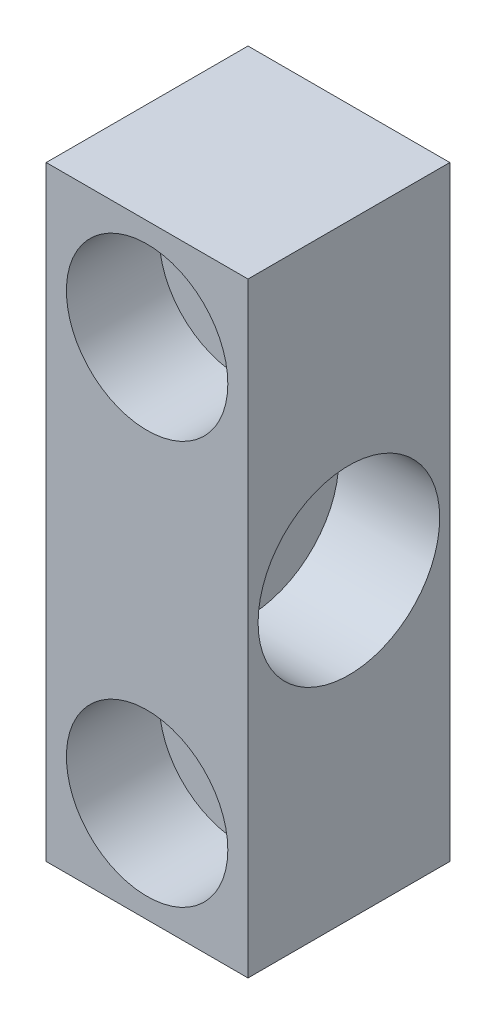
ISO-10303-21;
HEADER;
FILE_DESCRIPTION(('STEP AP214'),'2;1');
FILE_NAME('part.step','',(''),(''),'','','');
FILE_SCHEMA(('AUTOMOTIVE_DESIGN { 1 0 10303 214 1 1 1 1 }'));
ENDSEC;
DATA;
#1=APPLICATION_CONTEXT('core data for automotive mechanical design processes');
#2=APPLICATION_PROTOCOL_DEFINITION('international standard','automotive_design',2000,#1);
#3=PRODUCT_CONTEXT('',#1,'mechanical');
#4=PRODUCT('Part','Part','',(#3));
#5=PRODUCT_RELATED_PRODUCT_CATEGORY('part','',(#4));
#6=PRODUCT_DEFINITION_FORMATION('','',#4);
#7=PRODUCT_DEFINITION_CONTEXT('part definition',#1,'design');
#8=PRODUCT_DEFINITION('design','',#6,#7);
#9=PRODUCT_DEFINITION_SHAPE('','',#8);
#10=(LENGTH_UNIT() NAMED_UNIT(*) SI_UNIT(.MILLI.,.METRE.));
#11=(NAMED_UNIT(*) PLANE_ANGLE_UNIT() SI_UNIT($,.RADIAN.));
#12=(NAMED_UNIT(*) SI_UNIT($,.STERADIAN.) SOLID_ANGLE_UNIT());
#13=UNCERTAINTY_MEASURE_WITH_UNIT(LENGTH_MEASURE(1.E-05),#10,'distance_accuracy_value','');
#14=(GEOMETRIC_REPRESENTATION_CONTEXT(3) GLOBAL_UNCERTAINTY_ASSIGNED_CONTEXT((#13)) GLOBAL_UNIT_ASSIGNED_CONTEXT((#10,
#11,#12)) REPRESENTATION_CONTEXT('',''));
#15=CARTESIAN_POINT('',(0.,0.,0.));
#16=DIRECTION('',(0.,0.,1.));
#17=DIRECTION('',(1.,0.,0.));
#18=AXIS2_PLACEMENT_3D('',#15,#16,#17);
#19=CARTESIAN_POINT('',(5.,0.,5.));
#20=DIRECTION('',(1.,0.,0.));
#21=DIRECTION('',(0.,0.,-1.));
#22=AXIS2_PLACEMENT_3D('',#19,#20,#21);
#23=CYLINDRICAL_SURFACE('',#22,2.09999999999999);
#24=CARTESIAN_POINT('',(-5.,0.,5.));
#25=DIRECTION('',(1.,0.,0.));
#26=DIRECTION('',(0.,0.,-1.));
#27=AXIS2_PLACEMENT_3D('',#24,#25,#26);
#28=CIRCLE('',#27,2.09999999999999);
#29=CARTESIAN_POINT('',(-5.,0.,2.90000000000001));
#30=VERTEX_POINT('',#29);
#31=EDGE_CURVE('E139',#30,#30,#28,.T.);
#32=ORIENTED_EDGE('',*,*,#31,.F.);
#33=EDGE_LOOP('',(#32));
#34=FACE_BOUND('',#33,.T.);
#35=CARTESIAN_POINT('',(0.,0.,5.));
#36=DIRECTION('',(1.,0.,0.));
#37=DIRECTION('',(0.,0.,-1.));
#38=AXIS2_PLACEMENT_3D('',#35,#36,#37);
#39=CIRCLE('',#38,2.09999999999999);
#40=CARTESIAN_POINT('',(0.,0.,2.90000000000001));
#41=VERTEX_POINT('',#40);
#42=EDGE_CURVE('E40',#41,#41,#39,.F.);
#43=ORIENTED_EDGE('',*,*,#42,.F.);
#44=EDGE_LOOP('',(#43));
#45=FACE_BOUND('',#44,.T.);
#46=ADVANCED_FACE('F36',(#34,#45),#23,.F.);
#47=CARTESIAN_POINT('',(5.,-15.,10.));
#48=DIRECTION('',(-1.,0.,0.));
#49=DIRECTION('',(0.,0.,1.));
#50=AXIS2_PLACEMENT_3D('',#47,#48,#49);
#51=PLANE('',#50);
#52=CARTESIAN_POINT('',(5.,0.,5.));
#53=DIRECTION('',(1.,0.,0.));
#54=DIRECTION('',(0.,0.,-1.));
#55=AXIS2_PLACEMENT_3D('',#52,#53,#54);
#56=CIRCLE('',#55,4.5);
#57=CARTESIAN_POINT('',(5.,0.,0.5));
#58=VERTEX_POINT('',#57);
#59=EDGE_CURVE('E142',#58,#58,#56,.T.);
#60=ORIENTED_EDGE('',*,*,#59,.F.);
#61=EDGE_LOOP('',(#60));
#62=FACE_BOUND('',#61,.T.);
#63=DIRECTION('',(0.,1.,0.));
#64=VECTOR('',#63,1.);
#65=CARTESIAN_POINT('',(5.,-15.,0.));
#66=LINE('',#65,#64);
#67=CARTESIAN_POINT('',(5.,-15.,0.));
#68=VERTEX_POINT('',#67);
#69=CARTESIAN_POINT('',(5.,15.,0.));
#70=VERTEX_POINT('',#69);
#71=EDGE_CURVE('E102',#68,#70,#66,.T.);
#72=ORIENTED_EDGE('',*,*,#71,.T.);
#73=DIRECTION('',(0.,0.,-1.));
#74=VECTOR('',#73,1.);
#75=CARTESIAN_POINT('',(5.,15.,10.));
#76=LINE('',#75,#74);
#77=CARTESIAN_POINT('',(5.,15.,10.));
#78=VERTEX_POINT('',#77);
#79=EDGE_CURVE('E11',#78,#70,#76,.T.);
#80=ORIENTED_EDGE('',*,*,#79,.F.);
#81=DIRECTION('',(0.,1.,0.));
#82=VECTOR('',#81,1.);
#83=CARTESIAN_POINT('',(5.,-15.,10.));
#84=LINE('',#83,#82);
#85=CARTESIAN_POINT('',(5.,-15.,10.));
#86=VERTEX_POINT('',#85);
#87=EDGE_CURVE('E89',#86,#78,#84,.T.);
#88=ORIENTED_EDGE('',*,*,#87,.F.);
#89=DIRECTION('',(0.,0.,-1.));
#90=VECTOR('',#89,1.);
#91=CARTESIAN_POINT('',(5.,-15.,10.));
#92=LINE('',#91,#90);
#93=EDGE_CURVE('E98',#86,#68,#92,.T.);
#94=ORIENTED_EDGE('',*,*,#93,.T.);
#95=EDGE_LOOP('',(#72,#80,#88,#94));
#96=FACE_BOUND('',#95,.T.);
#97=ADVANCED_FACE('F38',(#62,#96),#51,.F.);
#98=CARTESIAN_POINT('',(-5.,15.,10.));
#99=DIRECTION('',(0.,-1.,0.));
#100=DIRECTION('',(0.,0.,-1.));
#101=AXIS2_PLACEMENT_3D('',#98,#99,#100);
#102=PLANE('',#101);
#103=DIRECTION('',(-1.,0.,0.));
#104=VECTOR('',#103,1.);
#105=CARTESIAN_POINT('',(-5.,15.,0.));
#106=LINE('',#105,#104);
#107=CARTESIAN_POINT('',(-5.,15.,0.));
#108=VERTEX_POINT('',#107);
#109=EDGE_CURVE('E93',#70,#108,#106,.T.);
#110=ORIENTED_EDGE('',*,*,#109,.T.);
#111=DIRECTION('',(0.,0.,-1.));
#112=VECTOR('',#111,1.);
#113=CARTESIAN_POINT('',(-5.,15.,10.));
#114=LINE('',#113,#112);
#115=CARTESIAN_POINT('',(-5.,15.,10.));
#116=VERTEX_POINT('',#115);
#117=EDGE_CURVE('E46',#116,#108,#114,.T.);
#118=ORIENTED_EDGE('',*,*,#117,.F.);
#119=DIRECTION('',(-1.,0.,0.));
#120=VECTOR('',#119,1.);
#121=CARTESIAN_POINT('',(-5.,15.,10.));
#122=LINE('',#121,#120);
#123=EDGE_CURVE('E84',#78,#116,#122,.T.);
#124=ORIENTED_EDGE('',*,*,#123,.F.);
#125=ORIENTED_EDGE('',*,*,#79,.T.);
#126=EDGE_LOOP('',(#110,#118,#124,#125));
#127=FACE_BOUND('',#126,.T.);
#128=ADVANCED_FACE('F92',(#127),#102,.F.);
#129=CARTESIAN_POINT('',(-5.,-15.,10.));
#130=DIRECTION('',(1.,0.,0.));
#131=DIRECTION('',(0.,0.,-1.));
#132=AXIS2_PLACEMENT_3D('',#129,#130,#131);
#133=PLANE('',#132);
#134=ORIENTED_EDGE('',*,*,#31,.T.);
#135=EDGE_LOOP('',(#134));
#136=FACE_BOUND('',#135,.T.);
#137=DIRECTION('',(0.,-1.,0.));
#138=VECTOR('',#137,1.);
#139=CARTESIAN_POINT('',(-5.,-15.,0.));
#140=LINE('',#139,#138);
#141=CARTESIAN_POINT('',(-5.,-15.,0.));
#142=VERTEX_POINT('',#141);
#143=EDGE_CURVE('E71',#108,#142,#140,.T.);
#144=ORIENTED_EDGE('',*,*,#143,.T.);
#145=DIRECTION('',(0.,0.,-1.));
#146=VECTOR('',#145,1.);
#147=CARTESIAN_POINT('',(-5.,-15.,10.));
#148=LINE('',#147,#146);
#149=CARTESIAN_POINT('',(-5.,-15.,10.));
#150=VERTEX_POINT('',#149);
#151=EDGE_CURVE('E94',#150,#142,#148,.T.);
#152=ORIENTED_EDGE('',*,*,#151,.F.);
#153=DIRECTION('',(0.,-1.,0.));
#154=VECTOR('',#153,1.);
#155=CARTESIAN_POINT('',(-5.,-15.,10.));
#156=LINE('',#155,#154);
#157=EDGE_CURVE('E87',#116,#150,#156,.T.);
#158=ORIENTED_EDGE('',*,*,#157,.F.);
#159=ORIENTED_EDGE('',*,*,#117,.T.);
#160=EDGE_LOOP('',(#144,#152,#158,#159));
#161=FACE_BOUND('',#160,.T.);
#162=ADVANCED_FACE('F96',(#136,#161),#133,.F.);
#163=CARTESIAN_POINT('',(-5.,-15.,10.));
#164=DIRECTION('',(0.,1.,0.));
#165=DIRECTION('',(0.,0.,1.));
#166=AXIS2_PLACEMENT_3D('',#163,#164,#165);
#167=PLANE('',#166);
#168=DIRECTION('',(1.,0.,0.));
#169=VECTOR('',#168,1.);
#170=CARTESIAN_POINT('',(-5.,-15.,0.));
#171=LINE('',#170,#169);
#172=EDGE_CURVE('E77',#142,#68,#171,.T.);
#173=ORIENTED_EDGE('',*,*,#172,.T.);
#174=ORIENTED_EDGE('',*,*,#93,.F.);
#175=DIRECTION('',(1.,0.,0.));
#176=VECTOR('',#175,1.);
#177=CARTESIAN_POINT('',(-5.,-15.,10.));
#178=LINE('',#177,#176);
#179=EDGE_CURVE('E54',#150,#86,#178,.T.);
#180=ORIENTED_EDGE('',*,*,#179,.F.);
#181=ORIENTED_EDGE('',*,*,#151,.T.);
#182=EDGE_LOOP('',(#173,#174,#180,#181));
#183=FACE_BOUND('',#182,.T.);
#184=ADVANCED_FACE('F110',(#183),#167,.F.);
#185=CARTESIAN_POINT('',(0.,0.,10.));
#186=DIRECTION('',(0.,0.,-1.));
#187=DIRECTION('',(-1.,0.,0.));
#188=AXIS2_PLACEMENT_3D('',#185,#186,#187);
#189=PLANE('',#188);
#190=CARTESIAN_POINT('',(0.,10.,10.));
#191=DIRECTION('',(0.,0.,1.));
#192=DIRECTION('',(1.,0.,0.));
#193=AXIS2_PLACEMENT_3D('',#190,#191,#192);
#194=CIRCLE('',#193,3.99999999999999);
#195=CARTESIAN_POINT('',(3.99999999999999,10.,10.));
#196=VERTEX_POINT('',#195);
#197=EDGE_CURVE('E136',#196,#196,#194,.T.);
#198=ORIENTED_EDGE('',*,*,#197,.F.);
#199=EDGE_LOOP('',(#198));
#200=FACE_BOUND('',#199,.T.);
#201=CARTESIAN_POINT('',(0.,-10.,10.));
#202=DIRECTION('',(0.,0.,1.));
#203=DIRECTION('',(1.,0.,0.));
#204=AXIS2_PLACEMENT_3D('',#201,#202,#203);
#205=CIRCLE('',#204,3.99999999999999);
#206=CARTESIAN_POINT('',(3.99999999999999,-10.,10.));
#207=VERTEX_POINT('',#206);
#208=EDGE_CURVE('E124',#207,#207,#205,.T.);
#209=ORIENTED_EDGE('',*,*,#208,.F.);
#210=EDGE_LOOP('',(#209));
#211=FACE_BOUND('',#210,.T.);
#212=ORIENTED_EDGE('',*,*,#87,.T.);
#213=ORIENTED_EDGE('',*,*,#123,.T.);
#214=ORIENTED_EDGE('',*,*,#157,.T.);
#215=ORIENTED_EDGE('',*,*,#179,.T.);
#216=EDGE_LOOP('',(#212,#213,#214,#215));
#217=FACE_BOUND('',#216,.T.);
#218=ADVANCED_FACE('F85',(#200,#211,#217),#189,.F.);
#219=CARTESIAN_POINT('',(0.,0.,0.));
#220=DIRECTION('',(0.,0.,-1.));
#221=DIRECTION('',(-1.,0.,0.));
#222=AXIS2_PLACEMENT_3D('',#219,#220,#221);
#223=PLANE('',#222);
#224=CARTESIAN_POINT('',(0.,10.,0.));
#225=DIRECTION('',(0.,0.,1.));
#226=DIRECTION('',(1.,0.,0.));
#227=AXIS2_PLACEMENT_3D('',#224,#225,#226);
#228=CIRCLE('',#227,2.25);
#229=CARTESIAN_POINT('',(2.25,10.,0.));
#230=VERTEX_POINT('',#229);
#231=EDGE_CURVE('E127',#230,#230,#228,.T.);
#232=ORIENTED_EDGE('',*,*,#231,.T.);
#233=EDGE_LOOP('',(#232));
#234=FACE_BOUND('',#233,.T.);
#235=CARTESIAN_POINT('',(0.,-10.,0.));
#236=DIRECTION('',(0.,0.,1.));
#237=DIRECTION('',(1.,0.,0.));
#238=AXIS2_PLACEMENT_3D('',#235,#236,#237);
#239=CIRCLE('',#238,2.25);
#240=CARTESIAN_POINT('',(2.25,-10.,0.));
#241=VERTEX_POINT('',#240);
#242=EDGE_CURVE('E105',#241,#241,#239,.T.);
#243=ORIENTED_EDGE('',*,*,#242,.T.);
#244=EDGE_LOOP('',(#243));
#245=FACE_BOUND('',#244,.T.);
#246=ORIENTED_EDGE('',*,*,#71,.F.);
#247=ORIENTED_EDGE('',*,*,#172,.F.);
#248=ORIENTED_EDGE('',*,*,#143,.F.);
#249=ORIENTED_EDGE('',*,*,#109,.F.);
#250=EDGE_LOOP('',(#246,#247,#248,#249));
#251=FACE_BOUND('',#250,.T.);
#252=ADVANCED_FACE('F113',(#234,#245,#251),#223,.T.);
#253=CARTESIAN_POINT('',(0.,-10.,10.));
#254=DIRECTION('',(0.,0.,1.));
#255=DIRECTION('',(1.,0.,0.));
#256=AXIS2_PLACEMENT_3D('',#253,#254,#255);
#257=CYLINDRICAL_SURFACE('',#256,2.25000000000001);
#258=ORIENTED_EDGE('',*,*,#242,.F.);
#259=EDGE_LOOP('',(#258));
#260=FACE_BOUND('',#259,.T.);
#261=CARTESIAN_POINT('',(0.,-10.,5.4));
#262=DIRECTION('',(0.,0.,1.));
#263=DIRECTION('',(1.,0.,0.));
#264=AXIS2_PLACEMENT_3D('',#261,#262,#263);
#265=CIRCLE('',#264,2.25000000000001);
#266=CARTESIAN_POINT('',(2.25000000000001,-10.,5.4));
#267=VERTEX_POINT('',#266);
#268=EDGE_CURVE('E118',#267,#267,#265,.T.);
#269=ORIENTED_EDGE('',*,*,#268,.T.);
#270=EDGE_LOOP('',(#269));
#271=FACE_BOUND('',#270,.T.);
#272=ADVANCED_FACE('F185',(#260,#271),#257,.F.);
#273=CARTESIAN_POINT('',(2.25000000000001,-10.,5.4));
#274=DIRECTION('',(0.,0.,-1.));
#275=DIRECTION('',(-1.,0.,0.));
#276=AXIS2_PLACEMENT_3D('',#273,#274,#275);
#277=PLANE('',#276);
#278=ORIENTED_EDGE('',*,*,#268,.F.);
#279=EDGE_LOOP('',(#278));
#280=FACE_BOUND('',#279,.T.);
#281=CARTESIAN_POINT('',(0.,-10.,5.4));
#282=DIRECTION('',(0.,0.,1.));
#283=DIRECTION('',(1.,0.,0.));
#284=AXIS2_PLACEMENT_3D('',#281,#282,#283);
#285=CIRCLE('',#284,3.99999999999999);
#286=CARTESIAN_POINT('',(3.99999999999999,-10.,5.4));
#287=VERTEX_POINT('',#286);
#288=EDGE_CURVE('E121',#287,#287,#285,.T.);
#289=ORIENTED_EDGE('',*,*,#288,.T.);
#290=EDGE_LOOP('',(#289));
#291=FACE_BOUND('',#290,.T.);
#292=ADVANCED_FACE('F181',(#280,#291),#277,.F.);
#293=CARTESIAN_POINT('',(0.,-10.,10.));
#294=DIRECTION('',(0.,0.,1.));
#295=DIRECTION('',(1.,0.,0.));
#296=AXIS2_PLACEMENT_3D('',#293,#294,#295);
#297=CYLINDRICAL_SURFACE('',#296,3.99999999999999);
#298=ORIENTED_EDGE('',*,*,#288,.F.);
#299=EDGE_LOOP('',(#298));
#300=FACE_BOUND('',#299,.T.);
#301=ORIENTED_EDGE('',*,*,#208,.T.);
#302=EDGE_LOOP('',(#301));
#303=FACE_BOUND('',#302,.T.);
#304=ADVANCED_FACE('F177',(#300,#303),#297,.F.);
#305=CARTESIAN_POINT('',(0.,10.,10.));
#306=DIRECTION('',(0.,0.,1.));
#307=DIRECTION('',(1.,0.,0.));
#308=AXIS2_PLACEMENT_3D('',#305,#306,#307);
#309=CYLINDRICAL_SURFACE('',#308,2.25000000000001);
#310=ORIENTED_EDGE('',*,*,#231,.F.);
#311=EDGE_LOOP('',(#310));
#312=FACE_BOUND('',#311,.T.);
#313=CARTESIAN_POINT('',(0.,10.,5.4));
#314=DIRECTION('',(0.,0.,1.));
#315=DIRECTION('',(1.,0.,0.));
#316=AXIS2_PLACEMENT_3D('',#313,#314,#315);
#317=CIRCLE('',#316,2.25000000000001);
#318=CARTESIAN_POINT('',(2.25000000000001,10.,5.4));
#319=VERTEX_POINT('',#318);
#320=EDGE_CURVE('E130',#319,#319,#317,.T.);
#321=ORIENTED_EDGE('',*,*,#320,.T.);
#322=EDGE_LOOP('',(#321));
#323=FACE_BOUND('',#322,.T.);
#324=ADVANCED_FACE('F173',(#312,#323),#309,.F.);
#325=CARTESIAN_POINT('',(2.25000000000001,10.,5.4));
#326=DIRECTION('',(0.,0.,-1.));
#327=DIRECTION('',(-1.,0.,0.));
#328=AXIS2_PLACEMENT_3D('',#325,#326,#327);
#329=PLANE('',#328);
#330=ORIENTED_EDGE('',*,*,#320,.F.);
#331=EDGE_LOOP('',(#330));
#332=FACE_BOUND('',#331,.T.);
#333=CARTESIAN_POINT('',(0.,10.,5.4));
#334=DIRECTION('',(0.,0.,1.));
#335=DIRECTION('',(1.,0.,0.));
#336=AXIS2_PLACEMENT_3D('',#333,#334,#335);
#337=CIRCLE('',#336,3.99999999999999);
#338=CARTESIAN_POINT('',(3.99999999999999,10.,5.4));
#339=VERTEX_POINT('',#338);
#340=EDGE_CURVE('E133',#339,#339,#337,.T.);
#341=ORIENTED_EDGE('',*,*,#340,.T.);
#342=EDGE_LOOP('',(#341));
#343=FACE_BOUND('',#342,.T.);
#344=ADVANCED_FACE('F169',(#332,#343),#329,.F.);
#345=CARTESIAN_POINT('',(0.,10.,10.));
#346=DIRECTION('',(0.,0.,1.));
#347=DIRECTION('',(1.,0.,0.));
#348=AXIS2_PLACEMENT_3D('',#345,#346,#347);
#349=CYLINDRICAL_SURFACE('',#348,3.99999999999999);
#350=ORIENTED_EDGE('',*,*,#340,.F.);
#351=EDGE_LOOP('',(#350));
#352=FACE_BOUND('',#351,.T.);
#353=ORIENTED_EDGE('',*,*,#197,.T.);
#354=EDGE_LOOP('',(#353));
#355=FACE_BOUND('',#354,.T.);
#356=ADVANCED_FACE('F166',(#352,#355),#349,.F.);
#357=CARTESIAN_POINT('',(0.,0.,5.));
#358=DIRECTION('',(1.,0.,0.));
#359=DIRECTION('',(0.,0.,-1.));
#360=AXIS2_PLACEMENT_3D('',#357,#358,#359);
#361=PLANE('',#360);
#362=CARTESIAN_POINT('',(0.,0.,5.));
#363=DIRECTION('',(1.,0.,0.));
#364=DIRECTION('',(0.,0.,-1.));
#365=AXIS2_PLACEMENT_3D('',#362,#363,#364);
#366=CIRCLE('',#365,4.5);
#367=CARTESIAN_POINT('',(0.,0.,0.5));
#368=VERTEX_POINT('',#367);
#369=EDGE_CURVE('E145',#368,#368,#366,.T.);
#370=ORIENTED_EDGE('',*,*,#369,.T.);
#371=EDGE_LOOP('',(#370));
#372=FACE_BOUND('',#371,.T.);
#373=ORIENTED_EDGE('',*,*,#42,.T.);
#374=EDGE_LOOP('',(#373));
#375=FACE_BOUND('',#374,.T.);
#376=ADVANCED_FACE('F152',(#372,#375),#361,.T.);
#377=CARTESIAN_POINT('',(0.,0.,5.));
#378=DIRECTION('',(1.,0.,0.));
#379=DIRECTION('',(0.,0.,-1.));
#380=AXIS2_PLACEMENT_3D('',#377,#378,#379);
#381=CYLINDRICAL_SURFACE('',#380,4.5);
#382=ORIENTED_EDGE('',*,*,#369,.F.);
#383=EDGE_LOOP('',(#382));
#384=FACE_BOUND('',#383,.T.);
#385=ORIENTED_EDGE('',*,*,#59,.T.);
#386=EDGE_LOOP('',(#385));
#387=FACE_BOUND('',#386,.T.);
#388=ADVANCED_FACE('F164',(#384,#387),#381,.F.);
#389=CLOSED_SHELL('',(#46,#97,#128,#162,#184,#218,#252,#272,#292,#304,#324,#344,#356,#376,#388));
#390=MANIFOLD_SOLID_BREP('B2',#389);
#391=ADVANCED_BREP_SHAPE_REPRESENTATION('',(#18,#390),#14);
#392=SHAPE_DEFINITION_REPRESENTATION(#9,#391);
ENDSEC;
END-ISO-10303-21;
